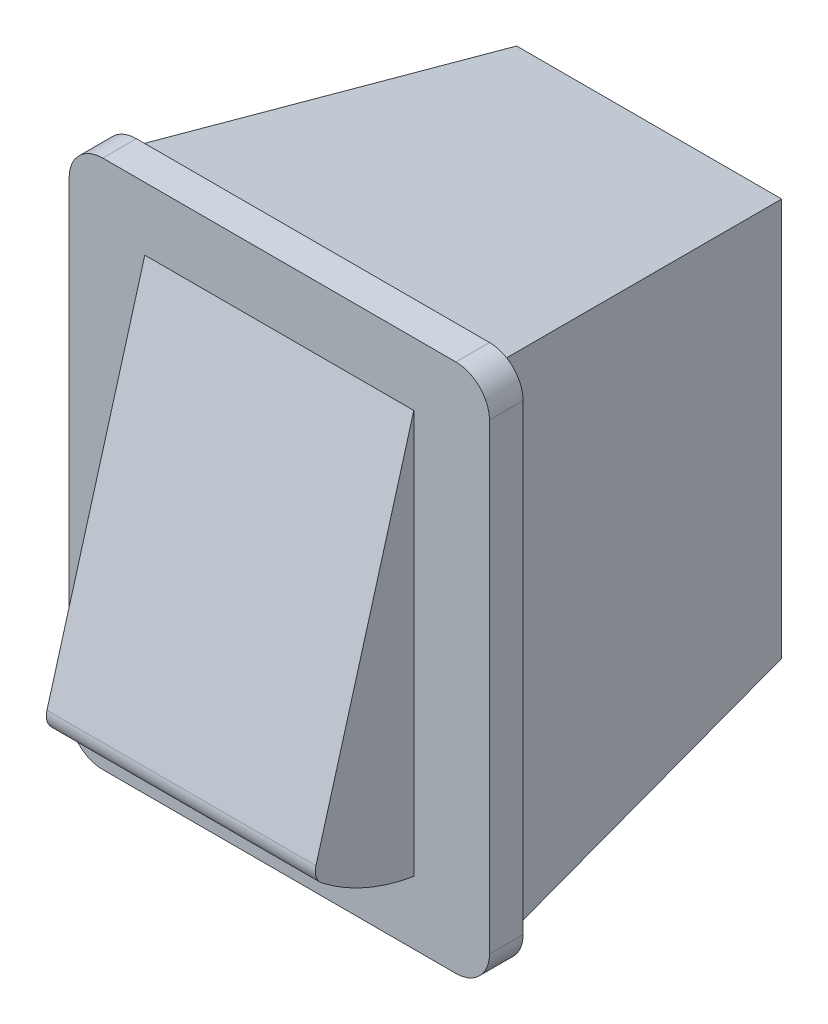
ISO-10303-21;
HEADER;
FILE_DESCRIPTION(('STEP AP214'),'2;1');
FILE_NAME('part.step','',(''),(''),'','','');
FILE_SCHEMA(('AUTOMOTIVE_DESIGN { 1 0 10303 214 1 1 1 1 }'));
ENDSEC;
DATA;
#1=APPLICATION_CONTEXT('core data for automotive mechanical design processes');
#2=APPLICATION_PROTOCOL_DEFINITION('international standard','automotive_design',2000,#1);
#3=PRODUCT_CONTEXT('',#1,'mechanical');
#4=PRODUCT('Part','Part','',(#3));
#5=PRODUCT_RELATED_PRODUCT_CATEGORY('part','',(#4));
#6=PRODUCT_DEFINITION_FORMATION('','',#4);
#7=PRODUCT_DEFINITION_CONTEXT('part definition',#1,'design');
#8=PRODUCT_DEFINITION('design','',#6,#7);
#9=PRODUCT_DEFINITION_SHAPE('','',#8);
#10=(LENGTH_UNIT() NAMED_UNIT(*) SI_UNIT(.MILLI.,.METRE.));
#11=(NAMED_UNIT(*) PLANE_ANGLE_UNIT() SI_UNIT($,.RADIAN.));
#12=(NAMED_UNIT(*) SI_UNIT($,.STERADIAN.) SOLID_ANGLE_UNIT());
#13=UNCERTAINTY_MEASURE_WITH_UNIT(LENGTH_MEASURE(1.E-05),#10,'distance_accuracy_value','');
#14=(GEOMETRIC_REPRESENTATION_CONTEXT(3) GLOBAL_UNCERTAINTY_ASSIGNED_CONTEXT((#13)) GLOBAL_UNIT_ASSIGNED_CONTEXT((#10,
#11,#12)) REPRESENTATION_CONTEXT('',''));
#15=CARTESIAN_POINT('',(0.,0.,0.));
#16=DIRECTION('',(0.,0.,1.));
#17=DIRECTION('',(1.,0.,0.));
#18=AXIS2_PLACEMENT_3D('',#15,#16,#17);
#19=CARTESIAN_POINT('',(10.5,-13.75,0.));
#20=DIRECTION('',(0.,0.,1.));
#21=DIRECTION('',(1.,0.,0.));
#22=AXIS2_PLACEMENT_3D('',#19,#20,#21);
#23=PLANE('',#22);
#24=CARTESIAN_POINT('',(10.5,-13.75,0.));
#25=DIRECTION('',(0.,0.,1.));
#26=DIRECTION('',(1.,0.,0.));
#27=AXIS2_PLACEMENT_3D('',#24,#25,#26);
#28=CIRCLE('',#27,2.);
#29=CARTESIAN_POINT('',(10.5,-15.75,0.));
#30=VERTEX_POINT('',#29);
#31=CARTESIAN_POINT('',(12.5,-13.75,0.));
#32=VERTEX_POINT('',#31);
#33=EDGE_CURVE('E207',#30,#32,#28,.T.);
#34=ORIENTED_EDGE('',*,*,#33,.F.);
#35=DIRECTION('',(1.,0.,0.));
#36=VECTOR('',#35,1.);
#37=CARTESIAN_POINT('',(-10.5,-15.75,0.));
#38=LINE('',#37,#36);
#39=CARTESIAN_POINT('',(-10.5,-15.75,0.));
#40=VERTEX_POINT('',#39);
#41=EDGE_CURVE('E212',#40,#30,#38,.T.);
#42=ORIENTED_EDGE('',*,*,#41,.F.);
#43=CARTESIAN_POINT('',(-10.5,-13.75,0.));
#44=DIRECTION('',(0.,0.,-1.));
#45=DIRECTION('',(-1.,0.,0.));
#46=AXIS2_PLACEMENT_3D('',#43,#44,#45);
#47=CIRCLE('',#46,2.);
#48=CARTESIAN_POINT('',(-12.5,-13.75,0.));
#49=VERTEX_POINT('',#48);
#50=EDGE_CURVE('E249',#40,#49,#47,.T.);
#51=ORIENTED_EDGE('',*,*,#50,.T.);
#52=DIRECTION('',(0.,1.,0.));
#53=VECTOR('',#52,1.);
#54=CARTESIAN_POINT('',(-12.5,-13.75,0.));
#55=LINE('',#54,#53);
#56=CARTESIAN_POINT('',(-12.5,13.75,0.));
#57=VERTEX_POINT('',#56);
#58=EDGE_CURVE('E246',#49,#57,#55,.T.);
#59=ORIENTED_EDGE('',*,*,#58,.T.);
#60=CARTESIAN_POINT('',(-10.5,13.75,0.));
#61=DIRECTION('',(0.,0.,-1.));
#62=DIRECTION('',(-1.,0.,0.));
#63=AXIS2_PLACEMENT_3D('',#60,#61,#62);
#64=CIRCLE('',#63,2.);
#65=CARTESIAN_POINT('',(-10.5,15.75,0.));
#66=VERTEX_POINT('',#65);
#67=EDGE_CURVE('E243',#57,#66,#64,.T.);
#68=ORIENTED_EDGE('',*,*,#67,.T.);
#69=DIRECTION('',(1.,0.,0.));
#70=VECTOR('',#69,1.);
#71=CARTESIAN_POINT('',(-10.5,15.75,0.));
#72=LINE('',#71,#70);
#73=CARTESIAN_POINT('',(10.5,15.75,0.));
#74=VERTEX_POINT('',#73);
#75=EDGE_CURVE('E240',#66,#74,#72,.T.);
#76=ORIENTED_EDGE('',*,*,#75,.T.);
#77=CARTESIAN_POINT('',(10.5,13.75,0.));
#78=DIRECTION('',(0.,0.,-1.));
#79=DIRECTION('',(-1.,0.,0.));
#80=AXIS2_PLACEMENT_3D('',#77,#78,#79);
#81=CIRCLE('',#80,2.);
#82=CARTESIAN_POINT('',(12.5,13.75,0.));
#83=VERTEX_POINT('',#82);
#84=EDGE_CURVE('E237',#74,#83,#81,.T.);
#85=ORIENTED_EDGE('',*,*,#84,.T.);
#86=DIRECTION('',(0.,1.,0.));
#87=VECTOR('',#86,1.);
#88=CARTESIAN_POINT('',(12.5,-13.75,0.));
#89=LINE('',#88,#87);
#90=EDGE_CURVE('E234',#32,#83,#89,.T.);
#91=ORIENTED_EDGE('',*,*,#90,.F.);
#92=EDGE_LOOP('',(#34,#42,#51,#59,#68,#76,#85,#91));
#93=FACE_BOUND('',#92,.T.);
#94=DIRECTION('',(0.,1.,0.));
#95=VECTOR('',#94,1.);
#96=CARTESIAN_POINT('',(-11.05,-15.,0.));
#97=LINE('',#96,#95);
#98=CARTESIAN_POINT('',(-11.05,-15.,0.));
#99=VERTEX_POINT('',#98);
#100=CARTESIAN_POINT('',(-11.05,15.,0.));
#101=VERTEX_POINT('',#100);
#102=EDGE_CURVE('E141',#99,#101,#97,.T.);
#103=ORIENTED_EDGE('',*,*,#102,.F.);
#104=DIRECTION('',(-1.,0.,0.));
#105=VECTOR('',#104,1.);
#106=CARTESIAN_POINT('',(11.05,-15.,0.));
#107=LINE('',#106,#105);
#108=CARTESIAN_POINT('',(11.05,-15.,0.));
#109=VERTEX_POINT('',#108);
#110=EDGE_CURVE('E143',#109,#99,#107,.T.);
#111=ORIENTED_EDGE('',*,*,#110,.F.);
#112=DIRECTION('',(0.,-1.,0.));
#113=VECTOR('',#112,1.);
#114=CARTESIAN_POINT('',(11.05,-15.,0.));
#115=LINE('',#114,#113);
#116=CARTESIAN_POINT('',(11.05,15.,0.));
#117=VERTEX_POINT('',#116);
#118=EDGE_CURVE('E52',#117,#109,#115,.T.);
#119=ORIENTED_EDGE('',*,*,#118,.F.);
#120=DIRECTION('',(1.,0.,0.));
#121=VECTOR('',#120,1.);
#122=CARTESIAN_POINT('',(11.05,15.,0.));
#123=LINE('',#122,#121);
#124=EDGE_CURVE('E47',#101,#117,#123,.T.);
#125=ORIENTED_EDGE('',*,*,#124,.F.);
#126=EDGE_LOOP('',(#103,#111,#119,#125));
#127=FACE_BOUND('',#126,.T.);
#128=ADVANCED_FACE('F32',(#93,#127),#23,.F.);
#129=CARTESIAN_POINT('',(10.5,-13.75,2.));
#130=DIRECTION('',(0.,0.,-1.));
#131=DIRECTION('',(-1.,0.,0.));
#132=AXIS2_PLACEMENT_3D('',#129,#130,#131);
#133=CYLINDRICAL_SURFACE('',#132,2.);
#134=ORIENTED_EDGE('',*,*,#33,.T.);
#135=DIRECTION('',(0.,0.,-1.));
#136=VECTOR('',#135,1.);
#137=CARTESIAN_POINT('',(12.5,-13.75,2.));
#138=LINE('',#137,#136);
#139=CARTESIAN_POINT('',(12.5,-13.75,2.));
#140=VERTEX_POINT('',#139);
#141=EDGE_CURVE('E11',#140,#32,#138,.T.);
#142=ORIENTED_EDGE('',*,*,#141,.F.);
#143=CARTESIAN_POINT('',(10.5,-13.75,2.));
#144=DIRECTION('',(0.,0.,1.));
#145=DIRECTION('',(1.,0.,0.));
#146=AXIS2_PLACEMENT_3D('',#143,#144,#145);
#147=CIRCLE('',#146,2.);
#148=CARTESIAN_POINT('',(10.5,-15.75,2.));
#149=VERTEX_POINT('',#148);
#150=EDGE_CURVE('E208',#149,#140,#147,.T.);
#151=ORIENTED_EDGE('',*,*,#150,.F.);
#152=DIRECTION('',(0.,0.,-1.));
#153=VECTOR('',#152,1.);
#154=CARTESIAN_POINT('',(10.5,-15.75,2.));
#155=LINE('',#154,#153);
#156=EDGE_CURVE('E231',#149,#30,#155,.T.);
#157=ORIENTED_EDGE('',*,*,#156,.T.);
#158=EDGE_LOOP('',(#134,#142,#151,#157));
#159=FACE_BOUND('',#158,.T.);
#160=ADVANCED_FACE('F34',(#159),#133,.T.);
#161=CARTESIAN_POINT('',(12.5,-13.75,2.));
#162=DIRECTION('',(-1.,0.,0.));
#163=DIRECTION('',(0.,0.,1.));
#164=AXIS2_PLACEMENT_3D('',#161,#162,#163);
#165=PLANE('',#164);
#166=ORIENTED_EDGE('',*,*,#90,.T.);
#167=DIRECTION('',(0.,0.,-1.));
#168=VECTOR('',#167,1.);
#169=CARTESIAN_POINT('',(12.5,13.75,2.));
#170=LINE('',#169,#168);
#171=CARTESIAN_POINT('',(12.5,13.75,2.));
#172=VERTEX_POINT('',#171);
#173=EDGE_CURVE('E40',#172,#83,#170,.T.);
#174=ORIENTED_EDGE('',*,*,#173,.F.);
#175=DIRECTION('',(0.,1.,0.));
#176=VECTOR('',#175,1.);
#177=CARTESIAN_POINT('',(12.5,-13.75,2.));
#178=LINE('',#177,#176);
#179=EDGE_CURVE('E211',#140,#172,#178,.T.);
#180=ORIENTED_EDGE('',*,*,#179,.F.);
#181=ORIENTED_EDGE('',*,*,#141,.T.);
#182=EDGE_LOOP('',(#166,#174,#180,#181));
#183=FACE_BOUND('',#182,.T.);
#184=ADVANCED_FACE('F270',(#183),#165,.F.);
#185=CARTESIAN_POINT('',(10.5,13.75,2.));
#186=DIRECTION('',(0.,0.,-1.));
#187=DIRECTION('',(-1.,0.,0.));
#188=AXIS2_PLACEMENT_3D('',#185,#186,#187);
#189=CYLINDRICAL_SURFACE('',#188,2.);
#190=ORIENTED_EDGE('',*,*,#84,.F.);
#191=DIRECTION('',(0.,0.,-1.));
#192=VECTOR('',#191,1.);
#193=CARTESIAN_POINT('',(10.5,15.75,2.));
#194=LINE('',#193,#192);
#195=CARTESIAN_POINT('',(10.5,15.75,2.));
#196=VERTEX_POINT('',#195);
#197=EDGE_CURVE('E263',#196,#74,#194,.T.);
#198=ORIENTED_EDGE('',*,*,#197,.F.);
#199=CARTESIAN_POINT('',(10.5,13.75,2.));
#200=DIRECTION('',(0.,0.,-1.));
#201=DIRECTION('',(-1.,0.,0.));
#202=AXIS2_PLACEMENT_3D('',#199,#200,#201);
#203=CIRCLE('',#202,2.);
#204=EDGE_CURVE('E214',#196,#172,#203,.T.);
#205=ORIENTED_EDGE('',*,*,#204,.T.);
#206=ORIENTED_EDGE('',*,*,#173,.T.);
#207=EDGE_LOOP('',(#190,#198,#205,#206));
#208=FACE_BOUND('',#207,.T.);
#209=ADVANCED_FACE('F267',(#208),#189,.T.);
#210=CARTESIAN_POINT('',(-10.5,15.75,2.));
#211=DIRECTION('',(0.,1.,0.));
#212=DIRECTION('',(0.,0.,1.));
#213=AXIS2_PLACEMENT_3D('',#210,#211,#212);
#214=PLANE('',#213);
#215=ORIENTED_EDGE('',*,*,#75,.F.);
#216=DIRECTION('',(0.,0.,-1.));
#217=VECTOR('',#216,1.);
#218=CARTESIAN_POINT('',(-10.5,15.75,2.));
#219=LINE('',#218,#217);
#220=CARTESIAN_POINT('',(-10.5,15.75,2.));
#221=VERTEX_POINT('',#220);
#222=EDGE_CURVE('E261',#221,#66,#219,.T.);
#223=ORIENTED_EDGE('',*,*,#222,.F.);
#224=DIRECTION('',(1.,0.,0.));
#225=VECTOR('',#224,1.);
#226=CARTESIAN_POINT('',(-10.5,15.75,2.));
#227=LINE('',#226,#225);
#228=EDGE_CURVE('E217',#221,#196,#227,.T.);
#229=ORIENTED_EDGE('',*,*,#228,.T.);
#230=ORIENTED_EDGE('',*,*,#197,.T.);
#231=EDGE_LOOP('',(#215,#223,#229,#230));
#232=FACE_BOUND('',#231,.T.);
#233=ADVANCED_FACE('F277',(#232),#214,.T.);
#234=CARTESIAN_POINT('',(-10.5,13.75,2.));
#235=DIRECTION('',(0.,0.,-1.));
#236=DIRECTION('',(-1.,0.,0.));
#237=AXIS2_PLACEMENT_3D('',#234,#235,#236);
#238=CYLINDRICAL_SURFACE('',#237,2.);
#239=ORIENTED_EDGE('',*,*,#67,.F.);
#240=DIRECTION('',(0.,0.,-1.));
#241=VECTOR('',#240,1.);
#242=CARTESIAN_POINT('',(-12.5,13.75,2.));
#243=LINE('',#242,#241);
#244=CARTESIAN_POINT('',(-12.5,13.75,2.));
#245=VERTEX_POINT('',#244);
#246=EDGE_CURVE('E259',#245,#57,#243,.T.);
#247=ORIENTED_EDGE('',*,*,#246,.F.);
#248=CARTESIAN_POINT('',(-10.5,13.75,2.));
#249=DIRECTION('',(0.,0.,-1.));
#250=DIRECTION('',(-1.,0.,0.));
#251=AXIS2_PLACEMENT_3D('',#248,#249,#250);
#252=CIRCLE('',#251,2.);
#253=EDGE_CURVE('E220',#245,#221,#252,.T.);
#254=ORIENTED_EDGE('',*,*,#253,.T.);
#255=ORIENTED_EDGE('',*,*,#222,.T.);
#256=EDGE_LOOP('',(#239,#247,#254,#255));
#257=FACE_BOUND('',#256,.T.);
#258=ADVANCED_FACE('F297',(#257),#238,.T.);
#259=CARTESIAN_POINT('',(-12.5,-13.75,2.));
#260=DIRECTION('',(-1.,0.,0.));
#261=DIRECTION('',(0.,0.,1.));
#262=AXIS2_PLACEMENT_3D('',#259,#260,#261);
#263=PLANE('',#262);
#264=ORIENTED_EDGE('',*,*,#58,.F.);
#265=DIRECTION('',(0.,0.,-1.));
#266=VECTOR('',#265,1.);
#267=CARTESIAN_POINT('',(-12.5,-13.75,2.));
#268=LINE('',#267,#266);
#269=CARTESIAN_POINT('',(-12.5,-13.75,2.));
#270=VERTEX_POINT('',#269);
#271=EDGE_CURVE('E257',#270,#49,#268,.T.);
#272=ORIENTED_EDGE('',*,*,#271,.F.);
#273=DIRECTION('',(0.,1.,0.));
#274=VECTOR('',#273,1.);
#275=CARTESIAN_POINT('',(-12.5,-13.75,2.));
#276=LINE('',#275,#274);
#277=EDGE_CURVE('E223',#270,#245,#276,.T.);
#278=ORIENTED_EDGE('',*,*,#277,.T.);
#279=ORIENTED_EDGE('',*,*,#246,.T.);
#280=EDGE_LOOP('',(#264,#272,#278,#279));
#281=FACE_BOUND('',#280,.T.);
#282=ADVANCED_FACE('F295',(#281),#263,.T.);
#283=CARTESIAN_POINT('',(-10.5,-13.75,2.));
#284=DIRECTION('',(0.,0.,-1.));
#285=DIRECTION('',(-1.,0.,0.));
#286=AXIS2_PLACEMENT_3D('',#283,#284,#285);
#287=CYLINDRICAL_SURFACE('',#286,2.);
#288=ORIENTED_EDGE('',*,*,#50,.F.);
#289=DIRECTION('',(0.,0.,-1.));
#290=VECTOR('',#289,1.);
#291=CARTESIAN_POINT('',(-10.5,-15.75,2.));
#292=LINE('',#291,#290);
#293=CARTESIAN_POINT('',(-10.5,-15.75,2.));
#294=VERTEX_POINT('',#293);
#295=EDGE_CURVE('E255',#294,#40,#292,.T.);
#296=ORIENTED_EDGE('',*,*,#295,.F.);
#297=CARTESIAN_POINT('',(-10.5,-13.75,2.));
#298=DIRECTION('',(0.,0.,-1.));
#299=DIRECTION('',(-1.,0.,0.));
#300=AXIS2_PLACEMENT_3D('',#297,#298,#299);
#301=CIRCLE('',#300,2.);
#302=EDGE_CURVE('E226',#294,#270,#301,.T.);
#303=ORIENTED_EDGE('',*,*,#302,.T.);
#304=ORIENTED_EDGE('',*,*,#271,.T.);
#305=EDGE_LOOP('',(#288,#296,#303,#304));
#306=FACE_BOUND('',#305,.T.);
#307=ADVANCED_FACE('F291',(#306),#287,.T.);
#308=CARTESIAN_POINT('',(-10.5,-15.75,2.));
#309=DIRECTION('',(0.,1.,0.));
#310=DIRECTION('',(0.,0.,1.));
#311=AXIS2_PLACEMENT_3D('',#308,#309,#310);
#312=PLANE('',#311);
#313=ORIENTED_EDGE('',*,*,#41,.T.);
#314=ORIENTED_EDGE('',*,*,#156,.F.);
#315=DIRECTION('',(1.,0.,0.));
#316=VECTOR('',#315,1.);
#317=CARTESIAN_POINT('',(-10.5,-15.75,2.));
#318=LINE('',#317,#316);
#319=EDGE_CURVE('E229',#294,#149,#318,.T.);
#320=ORIENTED_EDGE('',*,*,#319,.F.);
#321=ORIENTED_EDGE('',*,*,#295,.T.);
#322=EDGE_LOOP('',(#313,#314,#320,#321));
#323=FACE_BOUND('',#322,.T.);
#324=ADVANCED_FACE('F314',(#323),#312,.F.);
#325=CARTESIAN_POINT('',(10.5,-13.75,2.));
#326=DIRECTION('',(0.,0.,1.));
#327=DIRECTION('',(1.,0.,0.));
#328=AXIS2_PLACEMENT_3D('',#325,#326,#327);
#329=PLANE('',#328);
#330=DIRECTION('',(0.,1.,0.));
#331=VECTOR('',#330,1.);
#332=CARTESIAN_POINT('',(8.,12.000372018043,2.));
#333=LINE('',#332,#331);
#334=CARTESIAN_POINT('',(8.,-12.000372018043,2.));
#335=VERTEX_POINT('',#334);
#336=CARTESIAN_POINT('',(8.,12.000372018043,2.));
#337=VERTEX_POINT('',#336);
#338=EDGE_CURVE('E184',#335,#337,#333,.T.);
#339=ORIENTED_EDGE('',*,*,#338,.F.);
#340=DIRECTION('',(-1.,0.,0.));
#341=VECTOR('',#340,1.);
#342=CARTESIAN_POINT('',(8.,-12.000372018043,2.));
#343=LINE('',#342,#341);
#344=CARTESIAN_POINT('',(-8.,-12.000372018043,2.));
#345=VERTEX_POINT('',#344);
#346=EDGE_CURVE('E198',#335,#345,#343,.T.);
#347=ORIENTED_EDGE('',*,*,#346,.T.);
#348=DIRECTION('',(0.,1.,0.));
#349=VECTOR('',#348,1.);
#350=CARTESIAN_POINT('',(-8.,12.000372018043,2.));
#351=LINE('',#350,#349);
#352=CARTESIAN_POINT('',(-8.,12.000372018043,2.));
#353=VERTEX_POINT('',#352);
#354=EDGE_CURVE('E180',#345,#353,#351,.T.);
#355=ORIENTED_EDGE('',*,*,#354,.T.);
#356=DIRECTION('',(-1.,0.,0.));
#357=VECTOR('',#356,1.);
#358=CARTESIAN_POINT('',(8.,12.000372018043,2.));
#359=LINE('',#358,#357);
#360=EDGE_CURVE('E186',#337,#353,#359,.T.);
#361=ORIENTED_EDGE('',*,*,#360,.F.);
#362=EDGE_LOOP('',(#339,#347,#355,#361));
#363=FACE_BOUND('',#362,.T.);
#364=ORIENTED_EDGE('',*,*,#150,.T.);
#365=ORIENTED_EDGE('',*,*,#179,.T.);
#366=ORIENTED_EDGE('',*,*,#204,.F.);
#367=ORIENTED_EDGE('',*,*,#228,.F.);
#368=ORIENTED_EDGE('',*,*,#253,.F.);
#369=ORIENTED_EDGE('',*,*,#277,.F.);
#370=ORIENTED_EDGE('',*,*,#302,.F.);
#371=ORIENTED_EDGE('',*,*,#319,.T.);
#372=EDGE_LOOP('',(#364,#365,#366,#367,#368,#369,#370,#371));
#373=FACE_BOUND('',#372,.T.);
#374=ADVANCED_FACE('F280',(#363,#373),#329,.T.);
#375=CARTESIAN_POINT('',(8.,12.000372018043,2.));
#376=DIRECTION('',(0.,-0.272727272727273,-0.962091385841669));
#377=DIRECTION('',(0.,0.962091385841669,-0.272727272727273));
#378=AXIS2_PLACEMENT_3D('',#375,#376,#377);
#379=PLANE('',#378);
#380=DIRECTION('',(0.,-0.962091385841669,0.272727272727273));
#381=VECTOR('',#380,1.);
#382=CARTESIAN_POINT('',(-8.,12.000372018043,2.));
#383=LINE('',#382,#381);
#384=CARTESIAN_POINT('',(-8.,-8.53747787304372,7.8219332081204));
#385=VERTEX_POINT('',#384);
#386=EDGE_CURVE('E187',#353,#385,#383,.T.);
#387=ORIENTED_EDGE('',*,*,#386,.T.);
#388=DIRECTION('',(-1.,0.,0.));
#389=VECTOR('',#388,1.);
#390=CARTESIAN_POINT('',(8.,-8.53747787304372,7.8219332081204));
#391=LINE('',#390,#389);
#392=CARTESIAN_POINT('',(8.,-8.53747787304372,7.8219332081204));
#393=VERTEX_POINT('',#392);
#394=EDGE_CURVE('E204',#393,#385,#391,.T.);
#395=ORIENTED_EDGE('',*,*,#394,.F.);
#396=DIRECTION('',(0.,-0.962091385841669,0.272727272727273));
#397=VECTOR('',#396,1.);
#398=CARTESIAN_POINT('',(8.,12.000372018043,2.));
#399=LINE('',#398,#397);
#400=EDGE_CURVE('E176',#337,#393,#399,.T.);
#401=ORIENTED_EDGE('',*,*,#400,.F.);
#402=ORIENTED_EDGE('',*,*,#360,.T.);
#403=EDGE_LOOP('',(#387,#395,#401,#402));
#404=FACE_BOUND('',#403,.T.);
#405=ADVANCED_FACE('F332',(#404),#379,.F.);
#406=CARTESIAN_POINT('',(8.,-8.81020514577099,6.85984182227873));
#407=DIRECTION('',(-1.,0.,0.));
#408=DIRECTION('',(0.,0.,1.));
#409=AXIS2_PLACEMENT_3D('',#406,#407,#408);
#410=CYLINDRICAL_SURFACE('',#409,1.);
#411=CARTESIAN_POINT('',(-8.,-8.81020514577099,6.85984182227873));
#412=DIRECTION('',(1.,0.,0.));
#413=DIRECTION('',(0.,0.,-1.));
#414=AXIS2_PLACEMENT_3D('',#411,#412,#413);
#415=CIRCLE('',#414,1.);
#416=CARTESIAN_POINT('',(-8.,-9.5992334770757,7.47419863423616));
#417=VERTEX_POINT('',#416);
#418=EDGE_CURVE('E190',#385,#417,#415,.T.);
#419=ORIENTED_EDGE('',*,*,#418,.T.);
#420=DIRECTION('',(-1.,0.,0.));
#421=VECTOR('',#420,1.);
#422=CARTESIAN_POINT('',(8.,-9.5992334770757,7.47419863423616));
#423=LINE('',#422,#421);
#424=CARTESIAN_POINT('',(8.,-9.5992334770757,7.47419863423616));
#425=VERTEX_POINT('',#424);
#426=EDGE_CURVE('E201',#425,#417,#423,.T.);
#427=ORIENTED_EDGE('',*,*,#426,.F.);
#428=CARTESIAN_POINT('',(8.,-8.81020514577099,6.85984182227873));
#429=DIRECTION('',(1.,0.,0.));
#430=DIRECTION('',(0.,0.,-1.));
#431=AXIS2_PLACEMENT_3D('',#428,#429,#430);
#432=CIRCLE('',#431,1.);
#433=EDGE_CURVE('E179',#393,#425,#432,.T.);
#434=ORIENTED_EDGE('',*,*,#433,.F.);
#435=ORIENTED_EDGE('',*,*,#394,.T.);
#436=EDGE_LOOP('',(#419,#427,#434,#435));
#437=FACE_BOUND('',#436,.T.);
#438=ADVANCED_FACE('F339',(#437),#410,.T.);
#439=CARTESIAN_POINT('',(8.,0.,0.));
#440=DIRECTION('',(-1.,0.,0.));
#441=DIRECTION('',(0.,0.,1.));
#442=AXIS2_PLACEMENT_3D('',#439,#440,#441);
#443=CYLINDRICAL_SURFACE('',#442,12.1658920170873);
#444=CARTESIAN_POINT('',(-8.,0.,0.));
#445=DIRECTION('',(1.,0.,0.));
#446=DIRECTION('',(0.,0.,-1.));
#447=AXIS2_PLACEMENT_3D('',#444,#445,#446);
#448=CIRCLE('',#447,12.1658920170873);
#449=EDGE_CURVE('E192',#417,#345,#448,.T.);
#450=ORIENTED_EDGE('',*,*,#449,.T.);
#451=ORIENTED_EDGE('',*,*,#346,.F.);
#452=CARTESIAN_POINT('',(8.,0.,0.));
#453=DIRECTION('',(1.,0.,0.));
#454=DIRECTION('',(0.,0.,-1.));
#455=AXIS2_PLACEMENT_3D('',#452,#453,#454);
#456=CIRCLE('',#455,12.1658920170873);
#457=EDGE_CURVE('E182',#425,#335,#456,.T.);
#458=ORIENTED_EDGE('',*,*,#457,.F.);
#459=ORIENTED_EDGE('',*,*,#426,.T.);
#460=EDGE_LOOP('',(#450,#451,#458,#459));
#461=FACE_BOUND('',#460,.T.);
#462=ADVANCED_FACE('F346',(#461),#443,.T.);
#463=CARTESIAN_POINT('',(8.,-8.81020514577099,6.85984182227873));
#464=DIRECTION('',(1.,0.,0.));
#465=DIRECTION('',(0.,0.,-1.));
#466=AXIS2_PLACEMENT_3D('',#463,#464,#465);
#467=PLANE('',#466);
#468=ORIENTED_EDGE('',*,*,#400,.T.);
#469=ORIENTED_EDGE('',*,*,#433,.T.);
#470=ORIENTED_EDGE('',*,*,#457,.T.);
#471=ORIENTED_EDGE('',*,*,#338,.T.);
#472=EDGE_LOOP('',(#468,#469,#470,#471));
#473=FACE_BOUND('',#472,.T.);
#474=ADVANCED_FACE('F354',(#473),#467,.T.);
#475=CARTESIAN_POINT('',(-8.,-8.81020514577099,6.85984182227873));
#476=DIRECTION('',(1.,0.,0.));
#477=DIRECTION('',(0.,0.,-1.));
#478=AXIS2_PLACEMENT_3D('',#475,#476,#477);
#479=PLANE('',#478);
#480=ORIENTED_EDGE('',*,*,#386,.F.);
#481=ORIENTED_EDGE('',*,*,#354,.F.);
#482=ORIENTED_EDGE('',*,*,#449,.F.);
#483=ORIENTED_EDGE('',*,*,#418,.F.);
#484=EDGE_LOOP('',(#480,#481,#482,#483));
#485=FACE_BOUND('',#484,.T.);
#486=ADVANCED_FACE('F362',(#485),#479,.F.);
#487=CARTESIAN_POINT('',(-11.05,-15.,0.));
#488=DIRECTION('',(-0.987688340595138,0.,-0.156434465040231));
#489=DIRECTION('',(-0.156434465040231,0.,0.987688340595138));
#490=AXIS2_PLACEMENT_3D('',#487,#488,#489);
#491=PLANE('',#490);
#492=ORIENTED_EDGE('',*,*,#102,.T.);
#493=DIRECTION('',(-0.154554782932108,0.154554782932108,0.975820494837866));
#494=VECTOR('',#493,1.);
#495=CARTESIAN_POINT('',(-10.5220933015091,14.4720933015091,-3.33307171720414));
#496=LINE('',#495,#494);
#497=CARTESIAN_POINT('',(-7.88231119350927,11.8323111935093,-20.));
#498=VERTEX_POINT('',#497);
#499=EDGE_CURVE('E168',#498,#101,#496,.T.);
#500=ORIENTED_EDGE('',*,*,#499,.F.);
#501=DIRECTION('',(0.,-1.,0.));
#502=VECTOR('',#501,1.);
#503=CARTESIAN_POINT('',(-7.88231119350927,0.,-20.));
#504=LINE('',#503,#502);
#505=CARTESIAN_POINT('',(-7.88231119350927,-11.8323111935093,-20.));
#506=VERTEX_POINT('',#505);
#507=EDGE_CURVE('E157',#506,#498,#504,.F.);
#508=ORIENTED_EDGE('',*,*,#507,.F.);
#509=DIRECTION('',(-0.154554782932108,-0.154554782932108,0.975820494837866));
#510=VECTOR('',#509,1.);
#511=CARTESIAN_POINT('',(-11.05,-15.,0.));
#512=LINE('',#511,#510);
#513=EDGE_CURVE('E153',#506,#99,#512,.T.);
#514=ORIENTED_EDGE('',*,*,#513,.T.);
#515=EDGE_LOOP('',(#492,#500,#508,#514));
#516=FACE_BOUND('',#515,.T.);
#517=ADVANCED_FACE('F159',(#516),#491,.T.);
#518=CARTESIAN_POINT('',(11.05,15.,0.));
#519=DIRECTION('',(0.,0.987688340595138,-0.156434465040231));
#520=DIRECTION('',(0.,0.156434465040231,0.987688340595138));
#521=AXIS2_PLACEMENT_3D('',#518,#519,#520);
#522=PLANE('',#521);
#523=ORIENTED_EDGE('',*,*,#124,.T.);
#524=DIRECTION('',(0.154554782932108,0.154554782932108,0.975820494837866));
#525=VECTOR('',#524,1.);
#526=CARTESIAN_POINT('',(10.3333845721843,14.2833845721843,-4.52453174281105));
#527=LINE('',#526,#525);
#528=CARTESIAN_POINT('',(7.88231119350927,11.8323111935093,-20.));
#529=VERTEX_POINT('',#528);
#530=EDGE_CURVE('E163',#529,#117,#527,.T.);
#531=ORIENTED_EDGE('',*,*,#530,.F.);
#532=DIRECTION('',(-1.,0.,0.));
#533=VECTOR('',#532,1.);
#534=CARTESIAN_POINT('',(0.,11.8323111935093,-20.));
#535=LINE('',#534,#533);
#536=EDGE_CURVE('E173',#498,#529,#535,.F.);
#537=ORIENTED_EDGE('',*,*,#536,.F.);
#538=ORIENTED_EDGE('',*,*,#499,.T.);
#539=EDGE_LOOP('',(#523,#531,#537,#538));
#540=FACE_BOUND('',#539,.T.);
#541=ADVANCED_FACE('F377',(#540),#522,.T.);
#542=CARTESIAN_POINT('',(11.05,-15.,0.));
#543=DIRECTION('',(0.987688340595138,0.,-0.156434465040231));
#544=DIRECTION('',(-0.156434465040231,0.,-0.987688340595138));
#545=AXIS2_PLACEMENT_3D('',#542,#543,#544);
#546=PLANE('',#545);
#547=ORIENTED_EDGE('',*,*,#118,.T.);
#548=DIRECTION('',(0.154554782932108,-0.154554782932108,0.975820494837866));
#549=VECTOR('',#548,1.);
#550=CARTESIAN_POINT('',(11.05,-15.,0.));
#551=LINE('',#550,#549);
#552=CARTESIAN_POINT('',(7.88231119350927,-11.8323111935093,-20.));
#553=VERTEX_POINT('',#552);
#554=EDGE_CURVE('E156',#553,#109,#551,.T.);
#555=ORIENTED_EDGE('',*,*,#554,.F.);
#556=DIRECTION('',(0.,1.,0.));
#557=VECTOR('',#556,1.);
#558=CARTESIAN_POINT('',(7.88231119350927,0.,-20.));
#559=LINE('',#558,#557);
#560=EDGE_CURVE('E165',#529,#553,#559,.F.);
#561=ORIENTED_EDGE('',*,*,#560,.F.);
#562=ORIENTED_EDGE('',*,*,#530,.T.);
#563=EDGE_LOOP('',(#547,#555,#561,#562));
#564=FACE_BOUND('',#563,.T.);
#565=ADVANCED_FACE('F384',(#564),#546,.T.);
#566=CARTESIAN_POINT('',(11.05,-15.,0.));
#567=DIRECTION('',(0.,-0.987688340595138,-0.156434465040231));
#568=DIRECTION('',(0.,0.156434465040231,-0.987688340595138));
#569=AXIS2_PLACEMENT_3D('',#566,#567,#568);
#570=PLANE('',#569);
#571=ORIENTED_EDGE('',*,*,#110,.T.);
#572=ORIENTED_EDGE('',*,*,#513,.F.);
#573=DIRECTION('',(1.,0.,0.));
#574=VECTOR('',#573,1.);
#575=CARTESIAN_POINT('',(0.,-11.8323111935093,-20.));
#576=LINE('',#575,#574);
#577=EDGE_CURVE('E161',#553,#506,#576,.F.);
#578=ORIENTED_EDGE('',*,*,#577,.F.);
#579=ORIENTED_EDGE('',*,*,#554,.T.);
#580=EDGE_LOOP('',(#571,#572,#578,#579));
#581=FACE_BOUND('',#580,.T.);
#582=ADVANCED_FACE('F151',(#581),#570,.T.);
#583=CARTESIAN_POINT('',(0.,0.,-20.));
#584=DIRECTION('',(0.,0.,1.));
#585=DIRECTION('',(1.,0.,0.));
#586=AXIS2_PLACEMENT_3D('',#583,#584,#585);
#587=PLANE('',#586);
#588=ORIENTED_EDGE('',*,*,#507,.T.);
#589=ORIENTED_EDGE('',*,*,#536,.T.);
#590=ORIENTED_EDGE('',*,*,#560,.T.);
#591=ORIENTED_EDGE('',*,*,#577,.T.);
#592=EDGE_LOOP('',(#588,#589,#590,#591));
#593=FACE_BOUND('',#592,.T.);
#594=ADVANCED_FACE('F399',(#593),#587,.F.);
#595=CLOSED_SHELL('',(#128,#160,#184,#209,#233,#258,#282,#307,#324,#374,#405,#438,#462,#474,
#486,#517,#541,#565,#582,#594));
#596=MANIFOLD_SOLID_BREP('B2',#595);
#597=ADVANCED_BREP_SHAPE_REPRESENTATION('',(#18,#596),#14);
#598=SHAPE_DEFINITION_REPRESENTATION(#9,#597);
ENDSEC;
END-ISO-10303-21;
